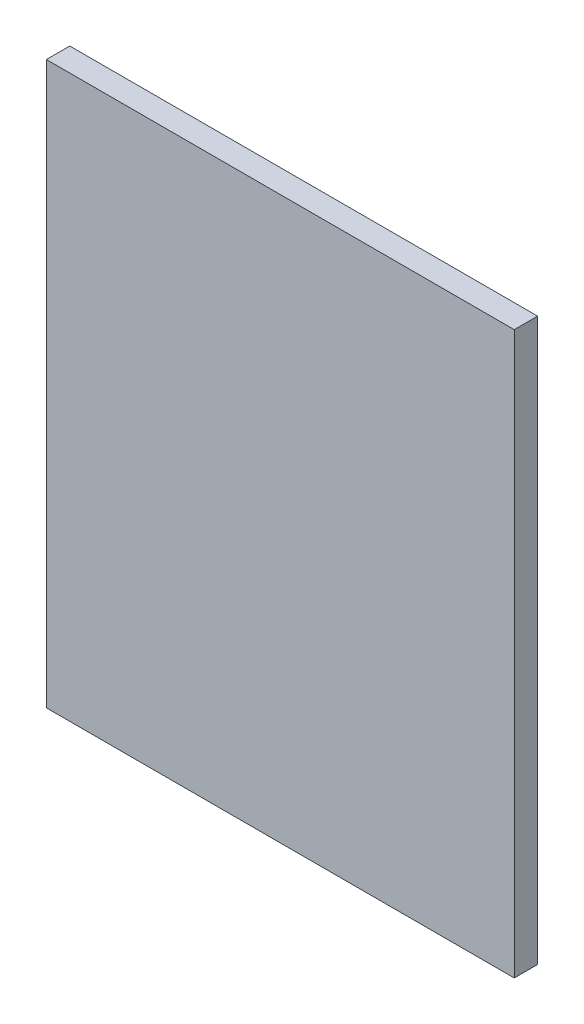
ISO-10303-21;
HEADER;
FILE_DESCRIPTION(('STEP AP214'),'2;1');
FILE_NAME('part.step','',(''),(''),'','','');
FILE_SCHEMA(('AUTOMOTIVE_DESIGN { 1 0 10303 214 1 1 1 1 }'));
ENDSEC;
DATA;
#1=APPLICATION_CONTEXT('core data for automotive mechanical design processes');
#2=APPLICATION_PROTOCOL_DEFINITION('international standard','automotive_design',2000,#1);
#3=PRODUCT_CONTEXT('',#1,'mechanical');
#4=PRODUCT('Part','Part','',(#3));
#5=PRODUCT_RELATED_PRODUCT_CATEGORY('part','',(#4));
#6=PRODUCT_DEFINITION_FORMATION('','',#4);
#7=PRODUCT_DEFINITION_CONTEXT('part definition',#1,'design');
#8=PRODUCT_DEFINITION('design','',#6,#7);
#9=PRODUCT_DEFINITION_SHAPE('','',#8);
#10=(LENGTH_UNIT() NAMED_UNIT(*) SI_UNIT(.MILLI.,.METRE.));
#11=(NAMED_UNIT(*) PLANE_ANGLE_UNIT() SI_UNIT($,.RADIAN.));
#12=(NAMED_UNIT(*) SI_UNIT($,.STERADIAN.) SOLID_ANGLE_UNIT());
#13=UNCERTAINTY_MEASURE_WITH_UNIT(LENGTH_MEASURE(1.E-05),#10,'distance_accuracy_value','');
#14=(GEOMETRIC_REPRESENTATION_CONTEXT(3) GLOBAL_UNCERTAINTY_ASSIGNED_CONTEXT((#13)) GLOBAL_UNIT_ASSIGNED_CONTEXT((#10,
#11,#12)) REPRESENTATION_CONTEXT('',''));
#15=CARTESIAN_POINT('',(0.,0.,0.));
#16=DIRECTION('',(0.,0.,1.));
#17=DIRECTION('',(1.,0.,0.));
#18=AXIS2_PLACEMENT_3D('',#15,#16,#17);
#19=CARTESIAN_POINT('',(31.75,-38.1,1.5875));
#20=DIRECTION('',(-1.,0.,0.));
#21=DIRECTION('',(0.,0.,1.));
#22=AXIS2_PLACEMENT_3D('',#19,#20,#21);
#23=PLANE('',#22);
#24=DIRECTION('',(0.,1.,0.));
#25=VECTOR('',#24,1.);
#26=CARTESIAN_POINT('',(31.75,-38.1,-1.5875));
#27=LINE('',#26,#25);
#28=CARTESIAN_POINT('',(31.75,-38.1,-1.5875));
#29=VERTEX_POINT('',#28);
#30=CARTESIAN_POINT('',(31.75,38.1,-1.5875));
#31=VERTEX_POINT('',#30);
#32=EDGE_CURVE('E96',#29,#31,#27,.T.);
#33=ORIENTED_EDGE('',*,*,#32,.T.);
#34=DIRECTION('',(0.,0.,-1.));
#35=VECTOR('',#34,1.);
#36=CARTESIAN_POINT('',(31.75,38.1,1.5875));
#37=LINE('',#36,#35);
#38=CARTESIAN_POINT('',(31.75,38.1,1.5875));
#39=VERTEX_POINT('',#38);
#40=EDGE_CURVE('E11',#39,#31,#37,.T.);
#41=ORIENTED_EDGE('',*,*,#40,.F.);
#42=DIRECTION('',(0.,1.,0.));
#43=VECTOR('',#42,1.);
#44=CARTESIAN_POINT('',(31.75,-38.1,1.5875));
#45=LINE('',#44,#43);
#46=CARTESIAN_POINT('',(31.75,-38.1,1.5875));
#47=VERTEX_POINT('',#46);
#48=EDGE_CURVE('E84',#47,#39,#45,.T.);
#49=ORIENTED_EDGE('',*,*,#48,.F.);
#50=DIRECTION('',(0.,0.,-1.));
#51=VECTOR('',#50,1.);
#52=CARTESIAN_POINT('',(31.75,-38.1,1.5875));
#53=LINE('',#52,#51);
#54=EDGE_CURVE('E92',#47,#29,#53,.T.);
#55=ORIENTED_EDGE('',*,*,#54,.T.);
#56=EDGE_LOOP('',(#33,#41,#49,#55));
#57=FACE_BOUND('',#56,.T.);
#58=ADVANCED_FACE('F33',(#57),#23,.F.);
#59=CARTESIAN_POINT('',(-31.75,38.1,1.5875));
#60=DIRECTION('',(0.,-1.,0.));
#61=DIRECTION('',(0.,0.,-1.));
#62=AXIS2_PLACEMENT_3D('',#59,#60,#61);
#63=PLANE('',#62);
#64=DIRECTION('',(-1.,0.,0.));
#65=VECTOR('',#64,1.);
#66=CARTESIAN_POINT('',(-31.75,38.1,-1.5875));
#67=LINE('',#66,#65);
#68=CARTESIAN_POINT('',(-31.75,38.1,-1.5875));
#69=VERTEX_POINT('',#68);
#70=EDGE_CURVE('E88',#31,#69,#67,.T.);
#71=ORIENTED_EDGE('',*,*,#70,.T.);
#72=DIRECTION('',(0.,0.,-1.));
#73=VECTOR('',#72,1.);
#74=CARTESIAN_POINT('',(-31.75,38.1,1.5875));
#75=LINE('',#74,#73);
#76=CARTESIAN_POINT('',(-31.75,38.1,1.5875));
#77=VERTEX_POINT('',#76);
#78=EDGE_CURVE('E41',#77,#69,#75,.T.);
#79=ORIENTED_EDGE('',*,*,#78,.F.);
#80=DIRECTION('',(-1.,0.,0.));
#81=VECTOR('',#80,1.);
#82=CARTESIAN_POINT('',(-31.75,38.1,1.5875));
#83=LINE('',#82,#81);
#84=EDGE_CURVE('E79',#39,#77,#83,.T.);
#85=ORIENTED_EDGE('',*,*,#84,.F.);
#86=ORIENTED_EDGE('',*,*,#40,.T.);
#87=EDGE_LOOP('',(#71,#79,#85,#86));
#88=FACE_BOUND('',#87,.T.);
#89=ADVANCED_FACE('F87',(#88),#63,.F.);
#90=CARTESIAN_POINT('',(-31.75,-38.1,1.5875));
#91=DIRECTION('',(1.,0.,0.));
#92=DIRECTION('',(0.,0.,-1.));
#93=AXIS2_PLACEMENT_3D('',#90,#91,#92);
#94=PLANE('',#93);
#95=DIRECTION('',(0.,-1.,0.));
#96=VECTOR('',#95,1.);
#97=CARTESIAN_POINT('',(-31.75,-38.1,-1.5875));
#98=LINE('',#97,#96);
#99=CARTESIAN_POINT('',(-31.75,-38.1,-1.5875));
#100=VERTEX_POINT('',#99);
#101=EDGE_CURVE('E66',#69,#100,#98,.T.);
#102=ORIENTED_EDGE('',*,*,#101,.T.);
#103=DIRECTION('',(0.,0.,-1.));
#104=VECTOR('',#103,1.);
#105=CARTESIAN_POINT('',(-31.75,-38.1,1.5875));
#106=LINE('',#105,#104);
#107=CARTESIAN_POINT('',(-31.75,-38.1,1.5875));
#108=VERTEX_POINT('',#107);
#109=EDGE_CURVE('E89',#108,#100,#106,.T.);
#110=ORIENTED_EDGE('',*,*,#109,.F.);
#111=DIRECTION('',(0.,-1.,0.));
#112=VECTOR('',#111,1.);
#113=CARTESIAN_POINT('',(-31.75,-38.1,1.5875));
#114=LINE('',#113,#112);
#115=EDGE_CURVE('E82',#77,#108,#114,.T.);
#116=ORIENTED_EDGE('',*,*,#115,.F.);
#117=ORIENTED_EDGE('',*,*,#78,.T.);
#118=EDGE_LOOP('',(#102,#110,#116,#117));
#119=FACE_BOUND('',#118,.T.);
#120=ADVANCED_FACE('F90',(#119),#94,.F.);
#121=CARTESIAN_POINT('',(-31.75,-38.1,1.5875));
#122=DIRECTION('',(0.,1.,0.));
#123=DIRECTION('',(0.,0.,1.));
#124=AXIS2_PLACEMENT_3D('',#121,#122,#123);
#125=PLANE('',#124);
#126=DIRECTION('',(1.,0.,0.));
#127=VECTOR('',#126,1.);
#128=CARTESIAN_POINT('',(-31.75,-38.1,-1.5875));
#129=LINE('',#128,#127);
#130=EDGE_CURVE('E72',#100,#29,#129,.T.);
#131=ORIENTED_EDGE('',*,*,#130,.T.);
#132=ORIENTED_EDGE('',*,*,#54,.F.);
#133=DIRECTION('',(1.,0.,0.));
#134=VECTOR('',#133,1.);
#135=CARTESIAN_POINT('',(-31.75,-38.1,1.5875));
#136=LINE('',#135,#134);
#137=EDGE_CURVE('E49',#108,#47,#136,.T.);
#138=ORIENTED_EDGE('',*,*,#137,.F.);
#139=ORIENTED_EDGE('',*,*,#109,.T.);
#140=EDGE_LOOP('',(#131,#132,#138,#139));
#141=FACE_BOUND('',#140,.T.);
#142=ADVANCED_FACE('F103',(#141),#125,.F.);
#143=CARTESIAN_POINT('',(0.,0.,1.5875));
#144=DIRECTION('',(0.,0.,-1.));
#145=DIRECTION('',(-1.,0.,0.));
#146=AXIS2_PLACEMENT_3D('',#143,#144,#145);
#147=PLANE('',#146);
#148=ORIENTED_EDGE('',*,*,#48,.T.);
#149=ORIENTED_EDGE('',*,*,#84,.T.);
#150=ORIENTED_EDGE('',*,*,#115,.T.);
#151=ORIENTED_EDGE('',*,*,#137,.T.);
#152=EDGE_LOOP('',(#148,#149,#150,#151));
#153=FACE_BOUND('',#152,.T.);
#154=ADVANCED_FACE('F80',(#153),#147,.F.);
#155=CARTESIAN_POINT('',(0.,0.,-1.5875));
#156=DIRECTION('',(0.,0.,-1.));
#157=DIRECTION('',(-1.,0.,0.));
#158=AXIS2_PLACEMENT_3D('',#155,#156,#157);
#159=PLANE('',#158);
#160=ORIENTED_EDGE('',*,*,#32,.F.);
#161=ORIENTED_EDGE('',*,*,#130,.F.);
#162=ORIENTED_EDGE('',*,*,#101,.F.);
#163=ORIENTED_EDGE('',*,*,#70,.F.);
#164=EDGE_LOOP('',(#160,#161,#162,#163));
#165=FACE_BOUND('',#164,.T.);
#166=ADVANCED_FACE('F106',(#165),#159,.T.);
#167=CLOSED_SHELL('',(#58,#89,#120,#142,#154,#166));
#168=MANIFOLD_SOLID_BREP('B2',#167);
#169=ADVANCED_BREP_SHAPE_REPRESENTATION('',(#18,#168),#14);
#170=SHAPE_DEFINITION_REPRESENTATION(#9,#169);
ENDSEC;
END-ISO-10303-21;
